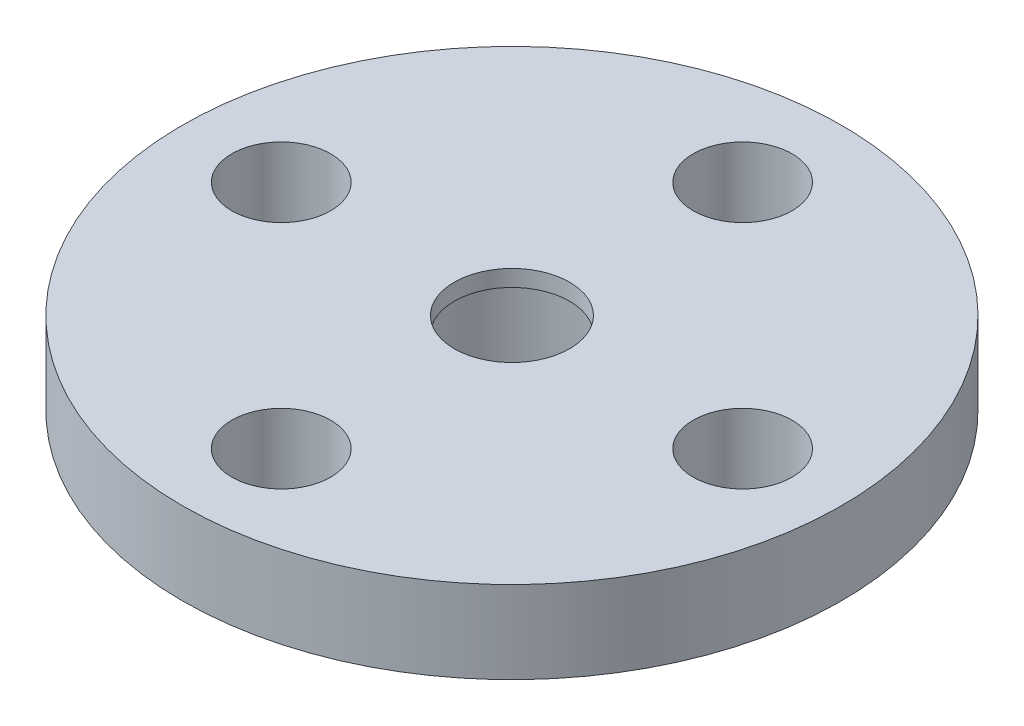
ISO-10303-21;
HEADER;
FILE_DESCRIPTION(('STEP AP214'),'2;1');
FILE_NAME('part.step','',(''),(''),'','','');
FILE_SCHEMA(('AUTOMOTIVE_DESIGN { 1 0 10303 214 1 1 1 1 }'));
ENDSEC;
DATA;
#1=APPLICATION_CONTEXT('core data for automotive mechanical design processes');
#2=APPLICATION_PROTOCOL_DEFINITION('international standard','automotive_design',2000,#1);
#3=PRODUCT_CONTEXT('',#1,'mechanical');
#4=PRODUCT('Part','Part','',(#3));
#5=PRODUCT_RELATED_PRODUCT_CATEGORY('part','',(#4));
#6=PRODUCT_DEFINITION_FORMATION('','',#4);
#7=PRODUCT_DEFINITION_CONTEXT('part definition',#1,'design');
#8=PRODUCT_DEFINITION('design','',#6,#7);
#9=PRODUCT_DEFINITION_SHAPE('','',#8);
#10=(LENGTH_UNIT() NAMED_UNIT(*) SI_UNIT(.MILLI.,.METRE.));
#11=(NAMED_UNIT(*) PLANE_ANGLE_UNIT() SI_UNIT($,.RADIAN.));
#12=(NAMED_UNIT(*) SI_UNIT($,.STERADIAN.) SOLID_ANGLE_UNIT());
#13=UNCERTAINTY_MEASURE_WITH_UNIT(LENGTH_MEASURE(1.E-05),#10,'distance_accuracy_value','');
#14=(GEOMETRIC_REPRESENTATION_CONTEXT(3) GLOBAL_UNCERTAINTY_ASSIGNED_CONTEXT((#13)) GLOBAL_UNIT_ASSIGNED_CONTEXT((#10,
#11,#12)) REPRESENTATION_CONTEXT('',''));
#15=CARTESIAN_POINT('',(0.,0.,0.));
#16=DIRECTION('',(0.,0.,1.));
#17=DIRECTION('',(1.,0.,0.));
#18=AXIS2_PLACEMENT_3D('',#15,#16,#17);
#19=CARTESIAN_POINT('',(0.,-2.,0.));
#20=DIRECTION('',(0.,1.,0.));
#21=DIRECTION('',(0.,0.,1.));
#22=AXIS2_PLACEMENT_3D('',#19,#20,#21);
#23=CYLINDRICAL_SURFACE('',#22,1.75);
#24=CARTESIAN_POINT('',(0.,2.5,0.));
#25=DIRECTION('',(0.,1.,0.));
#26=DIRECTION('',(0.,0.,1.));
#27=AXIS2_PLACEMENT_3D('',#24,#25,#26);
#28=CIRCLE('',#27,1.75);
#29=CARTESIAN_POINT('',(0.,2.5,1.75));
#30=VERTEX_POINT('',#29);
#31=EDGE_CURVE('E74',#30,#30,#28,.T.);
#32=ORIENTED_EDGE('',*,*,#31,.T.);
#33=EDGE_LOOP('',(#32));
#34=FACE_BOUND('',#33,.T.);
#35=CARTESIAN_POINT('',(0.,2.,0.));
#36=DIRECTION('',(0.,-1.,0.));
#37=DIRECTION('',(0.,0.,-1.));
#38=AXIS2_PLACEMENT_3D('',#35,#36,#37);
#39=CIRCLE('',#38,1.75);
#40=CARTESIAN_POINT('',(0.,2.,-1.75));
#41=VERTEX_POINT('',#40);
#42=EDGE_CURVE('E36',#41,#41,#39,.F.);
#43=ORIENTED_EDGE('',*,*,#42,.F.);
#44=EDGE_LOOP('',(#43));
#45=FACE_BOUND('',#44,.T.);
#46=ADVANCED_FACE('F32',(#34,#45),#23,.F.);
#47=CARTESIAN_POINT('',(0.,2.5,0.));
#48=DIRECTION('',(0.,-1.,0.));
#49=DIRECTION('',(0.,0.,-1.));
#50=AXIS2_PLACEMENT_3D('',#47,#48,#49);
#51=CYLINDRICAL_SURFACE('',#50,10.);
#52=CARTESIAN_POINT('',(0.,2.5,0.));
#53=DIRECTION('',(0.,1.,0.));
#54=DIRECTION('',(0.,0.,1.));
#55=AXIS2_PLACEMENT_3D('',#52,#53,#54);
#56=CIRCLE('',#55,10.);
#57=CARTESIAN_POINT('',(0.,2.5,10.));
#58=VERTEX_POINT('',#57);
#59=EDGE_CURVE('E40',#58,#58,#56,.T.);
#60=ORIENTED_EDGE('',*,*,#59,.F.);
#61=EDGE_LOOP('',(#60));
#62=FACE_BOUND('',#61,.T.);
#63=CARTESIAN_POINT('',(0.,0.,0.));
#64=DIRECTION('',(0.,1.,0.));
#65=DIRECTION('',(0.,0.,1.));
#66=AXIS2_PLACEMENT_3D('',#63,#64,#65);
#67=CIRCLE('',#66,10.);
#68=CARTESIAN_POINT('',(0.,0.,10.));
#69=VERTEX_POINT('',#68);
#70=EDGE_CURVE('E45',#69,#69,#67,.T.);
#71=ORIENTED_EDGE('',*,*,#70,.T.);
#72=EDGE_LOOP('',(#71));
#73=FACE_BOUND('',#72,.T.);
#74=ADVANCED_FACE('F34',(#62,#73),#51,.T.);
#75=CARTESIAN_POINT('',(0.,2.5,0.));
#76=DIRECTION('',(0.,1.,0.));
#77=DIRECTION('',(0.,0.,1.));
#78=AXIS2_PLACEMENT_3D('',#75,#76,#77);
#79=PLANE('',#78);
#80=CARTESIAN_POINT('',(0.,2.5,-7.));
#81=DIRECTION('',(0.,1.,0.));
#82=DIRECTION('',(0.,0.,1.));
#83=AXIS2_PLACEMENT_3D('',#80,#81,#82);
#84=CIRCLE('',#83,1.5);
#85=CARTESIAN_POINT('',(0.,2.5,-5.5));
#86=VERTEX_POINT('',#85);
#87=EDGE_CURVE('E53',#86,#86,#84,.T.);
#88=ORIENTED_EDGE('',*,*,#87,.F.);
#89=EDGE_LOOP('',(#88));
#90=FACE_BOUND('',#89,.T.);
#91=CARTESIAN_POINT('',(-6.9999999999998,2.5,1.98523339633126E-13));
#92=DIRECTION('',(0.,1.,0.));
#93=DIRECTION('',(0.,0.,1.));
#94=AXIS2_PLACEMENT_3D('',#91,#92,#93);
#95=CIRCLE('',#94,1.50000000000032);
#96=CARTESIAN_POINT('',(-6.9999999999998,2.5,1.50000000000052));
#97=VERTEX_POINT('',#96);
#98=EDGE_CURVE('E78',#97,#97,#95,.T.);
#99=ORIENTED_EDGE('',*,*,#98,.F.);
#100=EDGE_LOOP('',(#99));
#101=FACE_BOUND('',#100,.T.);
#102=CARTESIAN_POINT('',(3.95332173747447E-13,2.5,7.));
#103=DIRECTION('',(0.,1.,0.));
#104=DIRECTION('',(0.,0.,1.));
#105=AXIS2_PLACEMENT_3D('',#102,#103,#104);
#106=CIRCLE('',#105,1.50000000000042);
#107=CARTESIAN_POINT('',(3.95332173747447E-13,2.5,8.50000000000042));
#108=VERTEX_POINT('',#107);
#109=EDGE_CURVE('E75',#108,#108,#106,.T.);
#110=ORIENTED_EDGE('',*,*,#109,.F.);
#111=EDGE_LOOP('',(#110));
#112=FACE_BOUND('',#111,.T.);
#113=CARTESIAN_POINT('',(7.0000000000002,2.5,-1.97666086873723E-13));
#114=DIRECTION('',(0.,1.,0.));
#115=DIRECTION('',(0.,0.,1.));
#116=AXIS2_PLACEMENT_3D('',#113,#114,#115);
#117=CIRCLE('',#116,1.50000000000015);
#118=CARTESIAN_POINT('',(7.0000000000002,2.5,1.49999999999996));
#119=VERTEX_POINT('',#118);
#120=EDGE_CURVE('E71',#119,#119,#117,.T.);
#121=ORIENTED_EDGE('',*,*,#120,.F.);
#122=EDGE_LOOP('',(#121));
#123=FACE_BOUND('',#122,.T.);
#124=ORIENTED_EDGE('',*,*,#31,.F.);
#125=EDGE_LOOP('',(#124));
#126=FACE_BOUND('',#125,.T.);
#127=ORIENTED_EDGE('',*,*,#59,.T.);
#128=EDGE_LOOP('',(#127));
#129=FACE_BOUND('',#128,.T.);
#130=ADVANCED_FACE('F102',(#90,#101,#112,#123,#126,#129),#79,.T.);
#131=CARTESIAN_POINT('',(0.,0.,0.));
#132=DIRECTION('',(0.,1.,0.));
#133=DIRECTION('',(0.,0.,1.));
#134=AXIS2_PLACEMENT_3D('',#131,#132,#133);
#135=PLANE('',#134);
#136=CARTESIAN_POINT('',(0.,0.,-7.));
#137=DIRECTION('',(0.,1.,0.));
#138=DIRECTION('',(0.,0.,1.));
#139=AXIS2_PLACEMENT_3D('',#136,#137,#138);
#140=CIRCLE('',#139,1.5);
#141=CARTESIAN_POINT('',(0.,0.,-5.5));
#142=VERTEX_POINT('',#141);
#143=EDGE_CURVE('E58',#142,#142,#140,.T.);
#144=ORIENTED_EDGE('',*,*,#143,.T.);
#145=EDGE_LOOP('',(#144));
#146=FACE_BOUND('',#145,.T.);
#147=CARTESIAN_POINT('',(-6.9999999999998,0.,1.98523339633126E-13));
#148=DIRECTION('',(0.,1.,0.));
#149=DIRECTION('',(0.,0.,1.));
#150=AXIS2_PLACEMENT_3D('',#147,#148,#149);
#151=CIRCLE('',#150,1.50000000000032);
#152=CARTESIAN_POINT('',(-6.9999999999998,0.,1.50000000000052));
#153=VERTEX_POINT('',#152);
#154=EDGE_CURVE('E56',#153,#153,#151,.T.);
#155=ORIENTED_EDGE('',*,*,#154,.T.);
#156=EDGE_LOOP('',(#155));
#157=FACE_BOUND('',#156,.T.);
#158=CARTESIAN_POINT('',(3.95332173747447E-13,0.,7.));
#159=DIRECTION('',(0.,1.,0.));
#160=DIRECTION('',(0.,0.,1.));
#161=AXIS2_PLACEMENT_3D('',#158,#159,#160);
#162=CIRCLE('',#161,1.50000000000042);
#163=CARTESIAN_POINT('',(3.95332173747447E-13,0.,8.50000000000042));
#164=VERTEX_POINT('',#163);
#165=EDGE_CURVE('E52',#164,#164,#162,.T.);
#166=ORIENTED_EDGE('',*,*,#165,.T.);
#167=EDGE_LOOP('',(#166));
#168=FACE_BOUND('',#167,.T.);
#169=CARTESIAN_POINT('',(7.0000000000002,0.,-1.97666086873723E-13));
#170=DIRECTION('',(0.,1.,0.));
#171=DIRECTION('',(0.,0.,1.));
#172=AXIS2_PLACEMENT_3D('',#169,#170,#171);
#173=CIRCLE('',#172,1.50000000000015);
#174=CARTESIAN_POINT('',(7.0000000000002,0.,1.49999999999996));
#175=VERTEX_POINT('',#174);
#176=EDGE_CURVE('E49',#175,#175,#173,.T.);
#177=ORIENTED_EDGE('',*,*,#176,.T.);
#178=EDGE_LOOP('',(#177));
#179=FACE_BOUND('',#178,.T.);
#180=CARTESIAN_POINT('',(0.,0.,0.));
#181=DIRECTION('',(0.,1.,0.));
#182=DIRECTION('',(0.,0.,1.));
#183=AXIS2_PLACEMENT_3D('',#180,#181,#182);
#184=CIRCLE('',#183,4.5);
#185=CARTESIAN_POINT('',(0.,0.,4.5));
#186=VERTEX_POINT('',#185);
#187=EDGE_CURVE('E10',#186,#186,#184,.F.);
#188=ORIENTED_EDGE('',*,*,#187,.F.);
#189=EDGE_LOOP('',(#188));
#190=FACE_BOUND('',#189,.T.);
#191=ORIENTED_EDGE('',*,*,#70,.F.);
#192=EDGE_LOOP('',(#191));
#193=FACE_BOUND('',#192,.T.);
#194=ADVANCED_FACE('F120',(#146,#157,#168,#179,#190,#193),#135,.F.);
#195=CARTESIAN_POINT('',(0.,-2.,0.));
#196=DIRECTION('',(0.,-1.,0.));
#197=DIRECTION('',(0.,0.,-1.));
#198=AXIS2_PLACEMENT_3D('',#195,#196,#197);
#199=PLANE('',#198);
#200=CARTESIAN_POINT('',(0.,-2.,0.));
#201=DIRECTION('',(0.,-1.,0.));
#202=DIRECTION('',(0.,0.,-1.));
#203=AXIS2_PLACEMENT_3D('',#200,#201,#202);
#204=CIRCLE('',#203,4.5);
#205=CARTESIAN_POINT('',(0.,-2.,-4.5));
#206=VERTEX_POINT('',#205);
#207=EDGE_CURVE('E64',#206,#206,#204,.T.);
#208=ORIENTED_EDGE('',*,*,#207,.T.);
#209=EDGE_LOOP('',(#208));
#210=FACE_BOUND('',#209,.T.);
#211=CARTESIAN_POINT('',(0.,-2.,0.));
#212=DIRECTION('',(0.,-1.,0.));
#213=DIRECTION('',(0.,0.,-1.));
#214=AXIS2_PLACEMENT_3D('',#211,#212,#213);
#215=CIRCLE('',#214,3.);
#216=CARTESIAN_POINT('',(0.,-2.,-3.));
#217=VERTEX_POINT('',#216);
#218=EDGE_CURVE('E60',#217,#217,#215,.T.);
#219=ORIENTED_EDGE('',*,*,#218,.F.);
#220=EDGE_LOOP('',(#219));
#221=FACE_BOUND('',#220,.T.);
#222=ADVANCED_FACE('F117',(#210,#221),#199,.T.);
#223=CARTESIAN_POINT('',(0.,-2.,0.));
#224=DIRECTION('',(0.,1.,0.));
#225=DIRECTION('',(0.,0.,1.));
#226=AXIS2_PLACEMENT_3D('',#223,#224,#225);
#227=CYLINDRICAL_SURFACE('',#226,4.5);
#228=ORIENTED_EDGE('',*,*,#207,.F.);
#229=EDGE_LOOP('',(#228));
#230=FACE_BOUND('',#229,.T.);
#231=ORIENTED_EDGE('',*,*,#187,.T.);
#232=EDGE_LOOP('',(#231));
#233=FACE_BOUND('',#232,.T.);
#234=ADVANCED_FACE('F116',(#230,#233),#227,.T.);
#235=CARTESIAN_POINT('',(0.,-2.,0.));
#236=DIRECTION('',(0.,1.,0.));
#237=DIRECTION('',(0.,0.,1.));
#238=AXIS2_PLACEMENT_3D('',#235,#236,#237);
#239=CYLINDRICAL_SURFACE('',#238,3.);
#240=ORIENTED_EDGE('',*,*,#218,.T.);
#241=EDGE_LOOP('',(#240));
#242=FACE_BOUND('',#241,.T.);
#243=CARTESIAN_POINT('',(0.,2.,0.));
#244=DIRECTION('',(0.,-1.,0.));
#245=DIRECTION('',(0.,0.,-1.));
#246=AXIS2_PLACEMENT_3D('',#243,#244,#245);
#247=CIRCLE('',#246,3.);
#248=CARTESIAN_POINT('',(0.,2.,-3.));
#249=VERTEX_POINT('',#248);
#250=EDGE_CURVE('E85',#249,#249,#247,.T.);
#251=ORIENTED_EDGE('',*,*,#250,.F.);
#252=EDGE_LOOP('',(#251));
#253=FACE_BOUND('',#252,.T.);
#254=ADVANCED_FACE('F112',(#242,#253),#239,.F.);
#255=CARTESIAN_POINT('',(7.0000000000002,-2.,-1.97666086873723E-13));
#256=DIRECTION('',(0.,1.,0.));
#257=DIRECTION('',(0.,0.,1.));
#258=AXIS2_PLACEMENT_3D('',#255,#256,#257);
#259=CYLINDRICAL_SURFACE('',#258,1.50000000000015);
#260=ORIENTED_EDGE('',*,*,#120,.T.);
#261=EDGE_LOOP('',(#260));
#262=FACE_BOUND('',#261,.T.);
#263=ORIENTED_EDGE('',*,*,#176,.F.);
#264=EDGE_LOOP('',(#263));
#265=FACE_BOUND('',#264,.T.);
#266=ADVANCED_FACE('F108',(#262,#265),#259,.F.);
#267=CARTESIAN_POINT('',(3.95332173747447E-13,-2.,7.));
#268=DIRECTION('',(0.,1.,0.));
#269=DIRECTION('',(0.,0.,1.));
#270=AXIS2_PLACEMENT_3D('',#267,#268,#269);
#271=CYLINDRICAL_SURFACE('',#270,1.50000000000042);
#272=ORIENTED_EDGE('',*,*,#109,.T.);
#273=EDGE_LOOP('',(#272));
#274=FACE_BOUND('',#273,.T.);
#275=ORIENTED_EDGE('',*,*,#165,.F.);
#276=EDGE_LOOP('',(#275));
#277=FACE_BOUND('',#276,.T.);
#278=ADVANCED_FACE('F111',(#274,#277),#271,.F.);
#279=CARTESIAN_POINT('',(-6.9999999999998,-2.,1.98523339633126E-13));
#280=DIRECTION('',(0.,1.,0.));
#281=DIRECTION('',(0.,0.,1.));
#282=AXIS2_PLACEMENT_3D('',#279,#280,#281);
#283=CYLINDRICAL_SURFACE('',#282,1.50000000000032);
#284=ORIENTED_EDGE('',*,*,#98,.T.);
#285=EDGE_LOOP('',(#284));
#286=FACE_BOUND('',#285,.T.);
#287=ORIENTED_EDGE('',*,*,#154,.F.);
#288=EDGE_LOOP('',(#287));
#289=FACE_BOUND('',#288,.T.);
#290=ADVANCED_FACE('F106',(#286,#289),#283,.F.);
#291=CARTESIAN_POINT('',(0.,-2.,-7.));
#292=DIRECTION('',(0.,1.,0.));
#293=DIRECTION('',(0.,0.,1.));
#294=AXIS2_PLACEMENT_3D('',#291,#292,#293);
#295=CYLINDRICAL_SURFACE('',#294,1.5);
#296=ORIENTED_EDGE('',*,*,#87,.T.);
#297=EDGE_LOOP('',(#296));
#298=FACE_BOUND('',#297,.T.);
#299=ORIENTED_EDGE('',*,*,#143,.F.);
#300=EDGE_LOOP('',(#299));
#301=FACE_BOUND('',#300,.T.);
#302=ADVANCED_FACE('F148',(#298,#301),#295,.F.);
#303=CARTESIAN_POINT('',(0.,2.,0.));
#304=DIRECTION('',(0.,-1.,0.));
#305=DIRECTION('',(0.,0.,-1.));
#306=AXIS2_PLACEMENT_3D('',#303,#304,#305);
#307=PLANE('',#306);
#308=ORIENTED_EDGE('',*,*,#250,.T.);
#309=EDGE_LOOP('',(#308));
#310=FACE_BOUND('',#309,.T.);
#311=ORIENTED_EDGE('',*,*,#42,.T.);
#312=EDGE_LOOP('',(#311));
#313=FACE_BOUND('',#312,.T.);
#314=ADVANCED_FACE('F92',(#310,#313),#307,.T.);
#315=CLOSED_SHELL('',(#46,#74,#130,#194,#222,#234,#254,#266,#278,#290,#302,#314));
#316=MANIFOLD_SOLID_BREP('B2',#315);
#317=ADVANCED_BREP_SHAPE_REPRESENTATION('',(#18,#316),#14);
#318=SHAPE_DEFINITION_REPRESENTATION(#9,#317);
ENDSEC;
END-ISO-10303-21;
